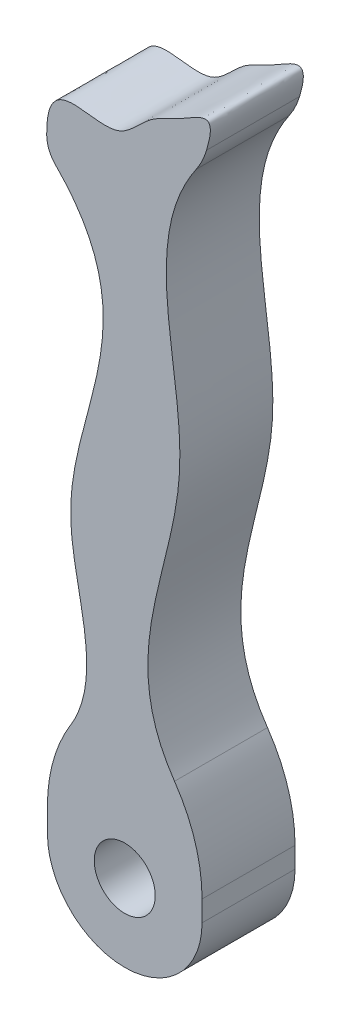
ISO-10303-21;
HEADER;
FILE_DESCRIPTION(('STEP AP214'),'2;1');
FILE_NAME('part.step','',(''),(''),'','','');
FILE_SCHEMA(('AUTOMOTIVE_DESIGN { 1 0 10303 214 1 1 1 1 }'));
ENDSEC;
DATA;
#1=APPLICATION_CONTEXT('core data for automotive mechanical design processes');
#2=APPLICATION_PROTOCOL_DEFINITION('international standard','automotive_design',2000,#1);
#3=PRODUCT_CONTEXT('',#1,'mechanical');
#4=PRODUCT('Part','Part','',(#3));
#5=PRODUCT_RELATED_PRODUCT_CATEGORY('part','',(#4));
#6=PRODUCT_DEFINITION_FORMATION('','',#4);
#7=PRODUCT_DEFINITION_CONTEXT('part definition',#1,'design');
#8=PRODUCT_DEFINITION('design','',#6,#7);
#9=PRODUCT_DEFINITION_SHAPE('','',#8);
#10=(LENGTH_UNIT() NAMED_UNIT(*) SI_UNIT(.MILLI.,.METRE.));
#11=(NAMED_UNIT(*) PLANE_ANGLE_UNIT() SI_UNIT($,.RADIAN.));
#12=(NAMED_UNIT(*) SI_UNIT($,.STERADIAN.) SOLID_ANGLE_UNIT());
#13=UNCERTAINTY_MEASURE_WITH_UNIT(LENGTH_MEASURE(1.E-05),#10,'distance_accuracy_value','');
#14=(GEOMETRIC_REPRESENTATION_CONTEXT(3) GLOBAL_UNCERTAINTY_ASSIGNED_CONTEXT((#13)) GLOBAL_UNIT_ASSIGNED_CONTEXT((#10,
#11,#12)) REPRESENTATION_CONTEXT('',''));
#15=CARTESIAN_POINT('',(0.,0.,0.));
#16=DIRECTION('',(0.,0.,1.));
#17=DIRECTION('',(1.,0.,0.));
#18=AXIS2_PLACEMENT_3D('',#15,#16,#17);
#19=CARTESIAN_POINT('',(1.78503387584342,16.477885226323,6.));
#20=DIRECTION('',(0.,0.,1.));
#21=DIRECTION('',(1.,0.,0.));
#22=AXIS2_PLACEMENT_3D('',#19,#20,#21);
#23=PLANE('',#22);
#24=CARTESIAN_POINT('',(4.99,-4.99,6.));
#25=DIRECTION('',(0.,0.,1.));
#26=DIRECTION('',(1.,0.,0.));
#27=AXIS2_PLACEMENT_3D('',#24,#25,#26);
#28=CIRCLE('',#27,1.96858446362772);
#29=CARTESIAN_POINT('',(6.95858446362772,-4.99,6.));
#30=VERTEX_POINT('',#29);
#31=EDGE_CURVE('E337',#30,#30,#28,.T.);
#32=ORIENTED_EDGE('',*,*,#31,.F.);
#33=EDGE_LOOP('',(#32));
#34=FACE_BOUND('',#33,.T.);
#35=DIRECTION('',(0.,-1.,0.));
#36=VECTOR('',#35,1.);
#37=CARTESIAN_POINT('',(0.,0.,6.));
#38=LINE('',#37,#36);
#39=CARTESIAN_POINT('',(0.,-3.43652522419146,6.));
#40=VERTEX_POINT('',#39);
#41=CARTESIAN_POINT('',(0.,-4.99,6.));
#42=VERTEX_POINT('',#41);
#43=EDGE_CURVE('E119',#40,#42,#38,.T.);
#44=ORIENTED_EDGE('',*,*,#43,.T.);
#45=CARTESIAN_POINT('',(4.99,-4.99,6.));
#46=DIRECTION('',(0.,0.,1.));
#47=DIRECTION('',(1.,0.,0.));
#48=AXIS2_PLACEMENT_3D('',#45,#46,#47);
#49=CIRCLE('',#48,4.99);
#50=CARTESIAN_POINT('',(9.98,-4.99,6.));
#51=VERTEX_POINT('',#50);
#52=EDGE_CURVE('E107',#42,#51,#49,.T.);
#53=ORIENTED_EDGE('',*,*,#52,.T.);
#54=DIRECTION('',(0.,1.,0.));
#55=VECTOR('',#54,1.);
#56=CARTESIAN_POINT('',(9.98,0.,6.));
#57=LINE('',#56,#55);
#58=CARTESIAN_POINT('',(9.98,-3.65724816774221,6.));
#59=VERTEX_POINT('',#58);
#60=EDGE_CURVE('E55',#51,#59,#57,.T.);
#61=ORIENTED_EDGE('',*,*,#60,.T.);
#62=CARTESIAN_POINT('',(-0.0199999999999957,-3.65724816774221,6.));
#63=DIRECTION('',(0.,0.,1.));
#64=DIRECTION('',(1.,0.,0.));
#65=AXIS2_PLACEMENT_3D('',#62,#63,#64);
#66=CIRCLE('',#65,10.);
#67=CARTESIAN_POINT('',(8.20201566567083,2.03471620261917,6.));
#68=VERTEX_POINT('',#67);
#69=EDGE_CURVE('E11',#59,#68,#66,.T.);
#70=ORIENTED_EDGE('',*,*,#69,.T.);
#71=CARTESIAN_POINT('',(9.98,0.,6.));
#72=CARTESIAN_POINT('',(3.34082582426599,6.22170216555836,6.));
#73=CARTESIAN_POINT('',(12.4925202425762,18.6724180113081,6.));
#74=CARTESIAN_POINT('',(5.58224032148655,31.7548499721674,6.));
#75=CARTESIAN_POINT('',(9.98,37.4598389960812,6.));
#76=B_SPLINE_CURVE_WITH_KNOTS('',3,(#71,#72,#73,#74,#75),.UNSPECIFIED.,.F.,.F.,(4,1,4),(0.,
0.521948664860024,1.),.UNSPECIFIED.);
#77=CARTESIAN_POINT('',(9.60193828681712,36.9409264571798,6.));
#78=VERTEX_POINT('',#77);
#79=EDGE_CURVE('E129',#68,#78,#76,.T.);
#80=ORIENTED_EDGE('',*,*,#79,.T.);
#81=CARTESIAN_POINT('',(5.4810351549118,39.7725615638723,6.));
#82=DIRECTION('',(0.,0.,1.));
#83=DIRECTION('',(1.,0.,0.));
#84=AXIS2_PLACEMENT_3D('',#81,#82,#83);
#85=CIRCLE('',#84,5.);
#86=CARTESIAN_POINT('',(10.2719650372902,38.3418306799763,6.));
#87=VERTEX_POINT('',#86);
#88=EDGE_CURVE('E314',#78,#87,#85,.T.);
#89=ORIENTED_EDGE('',*,*,#88,.T.);
#90=CARTESIAN_POINT('',(9.98,37.4598389960812,6.));
#91=CARTESIAN_POINT('',(11.3296722343924,41.2413493962628,6.));
#92=CARTESIAN_POINT('',(9.10810818143165,39.295033573459,6.));
#93=CARTESIAN_POINT('',(6.42208809956601,38.3860829066444,6.));
#94=CARTESIAN_POINT('',(3.95781619075629,34.8279032568476,6.));
#95=CARTESIAN_POINT('',(-0.475525657165952,38.4779835960952,6.));
#96=CARTESIAN_POINT('',(0.,33.1417306792919,6.));
#97=B_SPLINE_CURVE_WITH_KNOTS('',3,(#90,#91,#92,#93,#94,#95,#96),.UNSPECIFIED.,.F.,.F.,(4,1,1,1,
4),(0.,0.272209293652254,0.408954448071287,0.58075066176608,1.),.UNSPECIFIED.);
#98=CARTESIAN_POINT('',(-0.0474464032264683,34.0120468111497,6.));
#99=VERTEX_POINT('',#98);
#100=EDGE_CURVE('E142',#87,#99,#97,.T.);
#101=ORIENTED_EDGE('',*,*,#100,.T.);
#102=CARTESIAN_POINT('',(1.9523576482947,34.0400424450864,6.));
#103=DIRECTION('',(0.,0.,1.));
#104=DIRECTION('',(1.,0.,0.));
#105=AXIS2_PLACEMENT_3D('',#102,#103,#104);
#106=CIRCLE('',#105,2.);
#107=CARTESIAN_POINT('',(0.53358939333546,32.6303982918619,6.));
#108=VERTEX_POINT('',#107);
#109=EDGE_CURVE('E284',#99,#108,#106,.T.);
#110=ORIENTED_EDGE('',*,*,#109,.T.);
#111=CARTESIAN_POINT('',(0.,33.1417306792919,6.));
#112=CARTESIAN_POINT('',(7.18356445929876,26.5760956522926,6.));
#113=CARTESIAN_POINT('',(-2.67922524144056,15.5093451781135,6.));
#114=CARTESIAN_POINT('',(4.56221957353841,4.3346522363405,6.));
#115=CARTESIAN_POINT('',(0.,0.,6.));
#116=B_SPLINE_CURVE_WITH_KNOTS('',3,(#111,#112,#113,#114,#115),.UNSPECIFIED.,.F.,.F.,(4,1,4),
(0.,0.589573003127395,1.),.UNSPECIFIED.);
#117=CARTESIAN_POINT('',(1.47510642251011,1.79092056629471,6.));
#118=VERTEX_POINT('',#117);
#119=EDGE_CURVE('E127',#108,#118,#116,.T.);
#120=ORIENTED_EDGE('',*,*,#119,.T.);
#121=CARTESIAN_POINT('',(10.,-3.43652522419146,6.));
#122=DIRECTION('',(0.,0.,1.));
#123=DIRECTION('',(1.,0.,0.));
#124=AXIS2_PLACEMENT_3D('',#121,#122,#123);
#125=CIRCLE('',#124,10.);
#126=EDGE_CURVE('E126',#118,#40,#125,.T.);
#127=ORIENTED_EDGE('',*,*,#126,.T.);
#128=EDGE_LOOP('',(#44,#53,#61,#70,#80,#89,#101,#110,#120,#127));
#129=FACE_BOUND('',#128,.T.);
#130=ADVANCED_FACE('F33',(#34,#129),#23,.T.);
#131=CARTESIAN_POINT('',(1.78503387584342,16.477885226323,0.));
#132=DIRECTION('',(0.,0.,1.));
#133=DIRECTION('',(1.,0.,0.));
#134=AXIS2_PLACEMENT_3D('',#131,#132,#133);
#135=PLANE('',#134);
#136=CARTESIAN_POINT('',(4.99,-4.99,0.));
#137=DIRECTION('',(0.,0.,1.));
#138=DIRECTION('',(1.,0.,0.));
#139=AXIS2_PLACEMENT_3D('',#136,#137,#138);
#140=CIRCLE('',#139,1.96858446362772);
#141=CARTESIAN_POINT('',(6.95858446362772,-4.99,0.));
#142=VERTEX_POINT('',#141);
#143=EDGE_CURVE('E344',#142,#142,#140,.T.);
#144=ORIENTED_EDGE('',*,*,#143,.T.);
#145=EDGE_LOOP('',(#144));
#146=FACE_BOUND('',#145,.T.);
#147=CARTESIAN_POINT('',(4.99,-4.99,0.));
#148=DIRECTION('',(0.,0.,1.));
#149=DIRECTION('',(1.,0.,0.));
#150=AXIS2_PLACEMENT_3D('',#147,#148,#149);
#151=CIRCLE('',#150,4.99);
#152=CARTESIAN_POINT('',(0.,-4.99,0.));
#153=VERTEX_POINT('',#152);
#154=CARTESIAN_POINT('',(9.98,-4.99,0.));
#155=VERTEX_POINT('',#154);
#156=EDGE_CURVE('E48',#153,#155,#151,.T.);
#157=ORIENTED_EDGE('',*,*,#156,.F.);
#158=DIRECTION('',(0.,-1.,0.));
#159=VECTOR('',#158,1.);
#160=CARTESIAN_POINT('',(0.,0.,0.));
#161=LINE('',#160,#159);
#162=CARTESIAN_POINT('',(0.,-3.43652522419146,0.));
#163=VERTEX_POINT('',#162);
#164=EDGE_CURVE('E122',#163,#153,#161,.T.);
#165=ORIENTED_EDGE('',*,*,#164,.F.);
#166=CARTESIAN_POINT('',(10.,-3.43652522419146,0.));
#167=DIRECTION('',(0.,0.,1.));
#168=DIRECTION('',(1.,0.,0.));
#169=AXIS2_PLACEMENT_3D('',#166,#167,#168);
#170=CIRCLE('',#169,10.);
#171=CARTESIAN_POINT('',(1.47510642251011,1.79092056629471,0.));
#172=VERTEX_POINT('',#171);
#173=EDGE_CURVE('E293',#163,#172,#170,.F.);
#174=ORIENTED_EDGE('',*,*,#173,.T.);
#175=CARTESIAN_POINT('',(0.,33.1417306792919,0.));
#176=CARTESIAN_POINT('',(7.18356445929876,26.5760956522926,0.));
#177=CARTESIAN_POINT('',(-2.67922524144056,15.5093451781135,0.));
#178=CARTESIAN_POINT('',(4.56221957353841,4.3346522363405,0.));
#179=CARTESIAN_POINT('',(0.,0.,0.));
#180=B_SPLINE_CURVE_WITH_KNOTS('',3,(#175,#176,#177,#178,#179),.UNSPECIFIED.,.F.,.F.,(4,1,4),
(0.,0.589573003127395,1.),.UNSPECIFIED.);
#181=CARTESIAN_POINT('',(0.53358939333546,32.6303982918619,0.));
#182=VERTEX_POINT('',#181);
#183=EDGE_CURVE('E333',#182,#172,#180,.T.);
#184=ORIENTED_EDGE('',*,*,#183,.F.);
#185=CARTESIAN_POINT('',(1.9523576482947,34.0400424450864,0.));
#186=DIRECTION('',(0.,0.,1.));
#187=DIRECTION('',(1.,0.,0.));
#188=AXIS2_PLACEMENT_3D('',#185,#186,#187);
#189=CIRCLE('',#188,2.);
#190=CARTESIAN_POINT('',(-0.0474464032264683,34.0120468111497,0.));
#191=VERTEX_POINT('',#190);
#192=EDGE_CURVE('E282',#182,#191,#189,.F.);
#193=ORIENTED_EDGE('',*,*,#192,.T.);
#194=CARTESIAN_POINT('',(9.98,37.4598389960812,0.));
#195=CARTESIAN_POINT('',(11.3296722343924,41.2413493962628,0.));
#196=CARTESIAN_POINT('',(9.10810818143165,39.295033573459,0.));
#197=CARTESIAN_POINT('',(6.42208809956601,38.3860829066444,0.));
#198=CARTESIAN_POINT('',(3.95781619075629,34.8279032568476,0.));
#199=CARTESIAN_POINT('',(-0.475525657165952,38.4779835960952,0.));
#200=CARTESIAN_POINT('',(0.,33.1417306792919,0.));
#201=B_SPLINE_CURVE_WITH_KNOTS('',3,(#194,#195,#196,#197,#198,#199,#200),.UNSPECIFIED.,.F.,.F.,
(4,1,1,1,4),(0.,0.272209293652254,0.408954448071287,0.58075066176608,1.),.UNSPECIFIED.);
#202=CARTESIAN_POINT('',(10.2719650372902,38.3418306799764,0.));
#203=VERTEX_POINT('',#202);
#204=EDGE_CURVE('E131',#203,#191,#201,.T.);
#205=ORIENTED_EDGE('',*,*,#204,.F.);
#206=CARTESIAN_POINT('',(5.4810351549118,39.7725615638723,0.));
#207=DIRECTION('',(0.,0.,1.));
#208=DIRECTION('',(1.,0.,0.));
#209=AXIS2_PLACEMENT_3D('',#206,#207,#208);
#210=CIRCLE('',#209,5.);
#211=CARTESIAN_POINT('',(9.60193828681712,36.9409264571798,0.));
#212=VERTEX_POINT('',#211);
#213=EDGE_CURVE('E315',#203,#212,#210,.F.);
#214=ORIENTED_EDGE('',*,*,#213,.T.);
#215=CARTESIAN_POINT('',(9.98,0.,0.));
#216=CARTESIAN_POINT('',(3.34082582426599,6.22170216555836,0.));
#217=CARTESIAN_POINT('',(12.4925202425762,18.6724180113081,0.));
#218=CARTESIAN_POINT('',(5.58224032148655,31.7548499721674,0.));
#219=CARTESIAN_POINT('',(9.98,37.4598389960812,0.));
#220=B_SPLINE_CURVE_WITH_KNOTS('',3,(#215,#216,#217,#218,#219),.UNSPECIFIED.,.F.,.F.,(4,1,4),
(0.,0.521948664860024,1.),.UNSPECIFIED.);
#221=CARTESIAN_POINT('',(8.20201566567083,2.03471620261917,0.));
#222=VERTEX_POINT('',#221);
#223=EDGE_CURVE('E278',#222,#212,#220,.T.);
#224=ORIENTED_EDGE('',*,*,#223,.F.);
#225=CARTESIAN_POINT('',(-0.0199999999999957,-3.65724816774221,0.));
#226=DIRECTION('',(0.,0.,1.));
#227=DIRECTION('',(1.,0.,0.));
#228=AXIS2_PLACEMENT_3D('',#225,#226,#227);
#229=CIRCLE('',#228,10.);
#230=CARTESIAN_POINT('',(9.98,-3.65724816774221,0.));
#231=VERTEX_POINT('',#230);
#232=EDGE_CURVE('E301',#222,#231,#229,.F.);
#233=ORIENTED_EDGE('',*,*,#232,.T.);
#234=DIRECTION('',(0.,1.,0.));
#235=VECTOR('',#234,1.);
#236=CARTESIAN_POINT('',(9.98,0.,0.));
#237=LINE('',#236,#235);
#238=EDGE_CURVE('E306',#155,#231,#237,.T.);
#239=ORIENTED_EDGE('',*,*,#238,.F.);
#240=EDGE_LOOP('',(#157,#165,#174,#184,#193,#205,#214,#224,#233,#239));
#241=FACE_BOUND('',#240,.T.);
#242=ADVANCED_FACE('F162',(#146,#241),#135,.F.);
#243=CARTESIAN_POINT('',(9.98,0.,6.));
#244=DIRECTION('',(-1.,0.,0.));
#245=DIRECTION('',(0.,0.,1.));
#246=AXIS2_PLACEMENT_3D('',#243,#244,#245);
#247=PLANE('',#246);
#248=DIRECTION('',(0.,0.,1.));
#249=VECTOR('',#248,1.);
#250=CARTESIAN_POINT('',(9.98,-4.99,-4.));
#251=LINE('',#250,#249);
#252=EDGE_CURVE('E112',#155,#51,#251,.T.);
#253=ORIENTED_EDGE('',*,*,#252,.F.);
#254=ORIENTED_EDGE('',*,*,#238,.T.);
#255=DIRECTION('',(0.,0.,-1.));
#256=VECTOR('',#255,1.);
#257=CARTESIAN_POINT('',(9.98,-3.65724816774221,6.));
#258=LINE('',#257,#256);
#259=EDGE_CURVE('E41',#231,#59,#258,.F.);
#260=ORIENTED_EDGE('',*,*,#259,.T.);
#261=ORIENTED_EDGE('',*,*,#60,.F.);
#262=EDGE_LOOP('',(#253,#254,#260,#261));
#263=FACE_BOUND('',#262,.T.);
#264=ADVANCED_FACE('F158',(#263),#247,.F.);
#265=DIRECTION('',(0.,0.,-1.));
#266=VECTOR('',#265,1.);
#267=SURFACE_OF_LINEAR_EXTRUSION('',#116,#266);
#268=ORIENTED_EDGE('',*,*,#183,.T.);
#269=DIRECTION('',(0.,0.,-1.));
#270=VECTOR('',#269,1.);
#271=CARTESIAN_POINT('',(1.47510642251011,1.79092056629471,0.));
#272=LINE('',#271,#270);
#273=EDGE_CURVE('E295',#172,#118,#272,.F.);
#274=ORIENTED_EDGE('',*,*,#273,.T.);
#275=ORIENTED_EDGE('',*,*,#119,.F.);
#276=DIRECTION('',(0.,0.,-1.));
#277=VECTOR('',#276,1.);
#278=CARTESIAN_POINT('',(0.533589393335463,32.6303982918619,6.));
#279=LINE('',#278,#277);
#280=EDGE_CURVE('E288',#108,#182,#279,.T.);
#281=ORIENTED_EDGE('',*,*,#280,.T.);
#282=EDGE_LOOP('',(#268,#274,#275,#281));
#283=FACE_BOUND('',#282,.T.);
#284=ADVANCED_FACE('F161',(#283),#267,.F.);
#285=CARTESIAN_POINT('',(0.,0.,6.));
#286=DIRECTION('',(1.,0.,0.));
#287=DIRECTION('',(0.,1.,0.));
#288=AXIS2_PLACEMENT_3D('',#285,#286,#287);
#289=PLANE('',#288);
#290=ORIENTED_EDGE('',*,*,#164,.T.);
#291=DIRECTION('',(0.,0.,1.));
#292=VECTOR('',#291,1.);
#293=CARTESIAN_POINT('',(0.,-4.99,-4.));
#294=LINE('',#293,#292);
#295=EDGE_CURVE('E110',#153,#42,#294,.T.);
#296=ORIENTED_EDGE('',*,*,#295,.T.);
#297=ORIENTED_EDGE('',*,*,#43,.F.);
#298=DIRECTION('',(0.,0.,-1.));
#299=VECTOR('',#298,1.);
#300=CARTESIAN_POINT('',(0.,-3.43652522419146,6.));
#301=LINE('',#300,#299);
#302=EDGE_CURVE('E286',#40,#163,#301,.T.);
#303=ORIENTED_EDGE('',*,*,#302,.T.);
#304=EDGE_LOOP('',(#290,#296,#297,#303));
#305=FACE_BOUND('',#304,.T.);
#306=ADVANCED_FACE('F117',(#305),#289,.F.);
#307=DIRECTION('',(0.,0.,-1.));
#308=VECTOR('',#307,1.);
#309=SURFACE_OF_LINEAR_EXTRUSION('',#76,#308);
#310=ORIENTED_EDGE('',*,*,#79,.F.);
#311=DIRECTION('',(0.,0.,-1.));
#312=VECTOR('',#311,1.);
#313=CARTESIAN_POINT('',(8.20201566567084,2.03471620261917,6.));
#314=LINE('',#313,#312);
#315=EDGE_CURVE('E298',#68,#222,#314,.T.);
#316=ORIENTED_EDGE('',*,*,#315,.T.);
#317=ORIENTED_EDGE('',*,*,#223,.T.);
#318=DIRECTION('',(0.,0.,-1.));
#319=VECTOR('',#318,1.);
#320=CARTESIAN_POINT('',(9.60193828681711,36.9409264571798,0.));
#321=LINE('',#320,#319);
#322=EDGE_CURVE('E312',#212,#78,#321,.F.);
#323=ORIENTED_EDGE('',*,*,#322,.T.);
#324=EDGE_LOOP('',(#310,#316,#317,#323));
#325=FACE_BOUND('',#324,.T.);
#326=ADVANCED_FACE('F151',(#325),#309,.F.);
#327=DIRECTION('',(0.,0.,-1.));
#328=VECTOR('',#327,1.);
#329=SURFACE_OF_LINEAR_EXTRUSION('',#97,#328);
#330=ORIENTED_EDGE('',*,*,#204,.T.);
#331=DIRECTION('',(0.,0.,-1.));
#332=VECTOR('',#331,1.);
#333=CARTESIAN_POINT('',(-0.0474464032264685,34.0120468111497,0.));
#334=LINE('',#333,#332);
#335=EDGE_CURVE('E272',#191,#99,#334,.F.);
#336=ORIENTED_EDGE('',*,*,#335,.T.);
#337=ORIENTED_EDGE('',*,*,#100,.F.);
#338=DIRECTION('',(0.,0.,-1.));
#339=VECTOR('',#338,1.);
#340=CARTESIAN_POINT('',(10.2719650372902,38.3418306799765,6.));
#341=LINE('',#340,#339);
#342=EDGE_CURVE('E275',#87,#203,#341,.T.);
#343=ORIENTED_EDGE('',*,*,#342,.T.);
#344=EDGE_LOOP('',(#330,#336,#337,#343));
#345=FACE_BOUND('',#344,.T.);
#346=ADVANCED_FACE('F155',(#345),#329,.F.);
#347=CARTESIAN_POINT('',(4.99,-4.99,6.));
#348=DIRECTION('',(0.,0.,-1.));
#349=DIRECTION('',(-1.,0.,0.));
#350=AXIS2_PLACEMENT_3D('',#347,#348,#349);
#351=CYLINDRICAL_SURFACE('',#350,1.96858446362772);
#352=ORIENTED_EDGE('',*,*,#31,.T.);
#353=EDGE_LOOP('',(#352));
#354=FACE_BOUND('',#353,.T.);
#355=ORIENTED_EDGE('',*,*,#143,.F.);
#356=EDGE_LOOP('',(#355));
#357=FACE_BOUND('',#356,.T.);
#358=ADVANCED_FACE('F173',(#354,#357),#351,.F.);
#359=CARTESIAN_POINT('',(5.4810351549118,39.7725615638723,3.));
#360=DIRECTION('',(0.,0.,-1.));
#361=DIRECTION('',(-1.,0.,0.));
#362=AXIS2_PLACEMENT_3D('',#359,#360,#361);
#363=CYLINDRICAL_SURFACE('',#362,5.);
#364=ORIENTED_EDGE('',*,*,#88,.F.);
#365=ORIENTED_EDGE('',*,*,#322,.F.);
#366=ORIENTED_EDGE('',*,*,#213,.F.);
#367=ORIENTED_EDGE('',*,*,#342,.F.);
#368=EDGE_LOOP('',(#364,#365,#366,#367));
#369=FACE_BOUND('',#368,.T.);
#370=ADVANCED_FACE('F169',(#369),#363,.T.);
#371=CARTESIAN_POINT('',(1.9523576482947,34.0400424450864,3.));
#372=DIRECTION('',(0.,0.,-1.));
#373=DIRECTION('',(-1.,0.,0.));
#374=AXIS2_PLACEMENT_3D('',#371,#372,#373);
#375=CYLINDRICAL_SURFACE('',#374,2.);
#376=ORIENTED_EDGE('',*,*,#109,.F.);
#377=ORIENTED_EDGE('',*,*,#335,.F.);
#378=ORIENTED_EDGE('',*,*,#192,.F.);
#379=ORIENTED_EDGE('',*,*,#280,.F.);
#380=EDGE_LOOP('',(#376,#377,#378,#379));
#381=FACE_BOUND('',#380,.T.);
#382=ADVANCED_FACE('F172',(#381),#375,.T.);
#383=CARTESIAN_POINT('',(10.,-3.43652522419146,3.));
#384=DIRECTION('',(0.,0.,-1.));
#385=DIRECTION('',(-1.,0.,0.));
#386=AXIS2_PLACEMENT_3D('',#383,#384,#385);
#387=CYLINDRICAL_SURFACE('',#386,10.);
#388=ORIENTED_EDGE('',*,*,#126,.F.);
#389=ORIENTED_EDGE('',*,*,#273,.F.);
#390=ORIENTED_EDGE('',*,*,#173,.F.);
#391=ORIENTED_EDGE('',*,*,#302,.F.);
#392=EDGE_LOOP('',(#388,#389,#390,#391));
#393=FACE_BOUND('',#392,.T.);
#394=ADVANCED_FACE('F176',(#393),#387,.T.);
#395=CARTESIAN_POINT('',(-0.0199999999999957,-3.65724816774221,3.));
#396=DIRECTION('',(0.,0.,-1.));
#397=DIRECTION('',(-1.,0.,0.));
#398=AXIS2_PLACEMENT_3D('',#395,#396,#397);
#399=CYLINDRICAL_SURFACE('',#398,10.);
#400=ORIENTED_EDGE('',*,*,#69,.F.);
#401=ORIENTED_EDGE('',*,*,#259,.F.);
#402=ORIENTED_EDGE('',*,*,#232,.F.);
#403=ORIENTED_EDGE('',*,*,#315,.F.);
#404=EDGE_LOOP('',(#400,#401,#402,#403));
#405=FACE_BOUND('',#404,.T.);
#406=ADVANCED_FACE('F35',(#405),#399,.T.);
#407=CARTESIAN_POINT('',(4.99,-4.99,-4.));
#408=DIRECTION('',(0.,0.,1.));
#409=DIRECTION('',(1.,0.,0.));
#410=AXIS2_PLACEMENT_3D('',#407,#408,#409);
#411=CYLINDRICAL_SURFACE('',#410,4.99);
#412=ORIENTED_EDGE('',*,*,#156,.T.);
#413=ORIENTED_EDGE('',*,*,#252,.T.);
#414=ORIENTED_EDGE('',*,*,#52,.F.);
#415=ORIENTED_EDGE('',*,*,#295,.F.);
#416=EDGE_LOOP('',(#412,#413,#414,#415));
#417=FACE_BOUND('',#416,.T.);
#418=ADVANCED_FACE('F109',(#417),#411,.T.);
#419=CLOSED_SHELL('',(#130,#242,#264,#284,#306,#326,#346,#358,#370,#382,#394,#406,#418));
#420=MANIFOLD_SOLID_BREP('B2',#419);
#421=ADVANCED_BREP_SHAPE_REPRESENTATION('',(#18,#420),#14);
#422=SHAPE_DEFINITION_REPRESENTATION(#9,#421);
ENDSEC;
END-ISO-10303-21;
